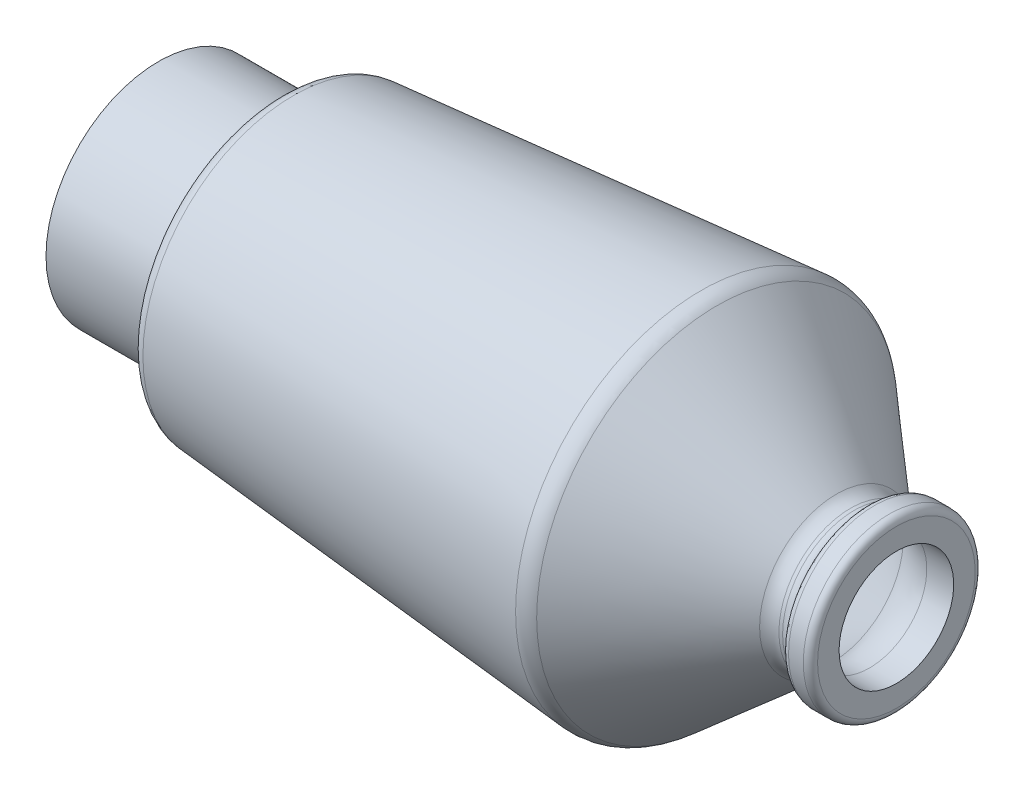
ISO-10303-21;
HEADER;
FILE_DESCRIPTION(('STEP AP214'),'2;1');
FILE_NAME('part.step','',(''),(''),'','','');
FILE_SCHEMA(('AUTOMOTIVE_DESIGN { 1 0 10303 214 1 1 1 1 }'));
ENDSEC;
DATA;
#1=APPLICATION_CONTEXT('core data for automotive mechanical design processes');
#2=APPLICATION_PROTOCOL_DEFINITION('international standard','automotive_design',2000,#1);
#3=PRODUCT_CONTEXT('',#1,'mechanical');
#4=PRODUCT('Part','Part','',(#3));
#5=PRODUCT_RELATED_PRODUCT_CATEGORY('part','',(#4));
#6=PRODUCT_DEFINITION_FORMATION('','',#4);
#7=PRODUCT_DEFINITION_CONTEXT('part definition',#1,'design');
#8=PRODUCT_DEFINITION('design','',#6,#7);
#9=PRODUCT_DEFINITION_SHAPE('','',#8);
#10=(LENGTH_UNIT() NAMED_UNIT(*) SI_UNIT(.MILLI.,.METRE.));
#11=(NAMED_UNIT(*) PLANE_ANGLE_UNIT() SI_UNIT($,.RADIAN.));
#12=(NAMED_UNIT(*) SI_UNIT($,.STERADIAN.) SOLID_ANGLE_UNIT());
#13=UNCERTAINTY_MEASURE_WITH_UNIT(LENGTH_MEASURE(1.E-05),#10,'distance_accuracy_value','');
#14=(GEOMETRIC_REPRESENTATION_CONTEXT(3) GLOBAL_UNCERTAINTY_ASSIGNED_CONTEXT((#13)) GLOBAL_UNIT_ASSIGNED_CONTEXT((#10,
#11,#12)) REPRESENTATION_CONTEXT('',''));
#15=CARTESIAN_POINT('',(0.,0.,0.));
#16=DIRECTION('',(0.,0.,1.));
#17=DIRECTION('',(1.,0.,0.));
#18=AXIS2_PLACEMENT_3D('',#15,#16,#17);
#19=CARTESIAN_POINT('',(0.,7.35,0.));
#20=DIRECTION('',(1.,0.,0.));
#21=DIRECTION('',(0.,0.,-1.));
#22=AXIS2_PLACEMENT_3D('',#19,#20,#21);
#23=PLANE('',#22);
#24=CARTESIAN_POINT('',(0.,0.,0.));
#25=DIRECTION('',(-1.,0.,0.));
#26=DIRECTION('',(0.,0.,1.));
#27=AXIS2_PLACEMENT_3D('',#24,#25,#26);
#28=CIRCLE('',#27,7.35);
#29=CARTESIAN_POINT('',(0.,0.,7.35));
#30=VERTEX_POINT('',#29);
#31=EDGE_CURVE('E10',#30,#30,#28,.T.);
#32=ORIENTED_EDGE('',*,*,#31,.F.);
#33=EDGE_LOOP('',(#32));
#34=FACE_BOUND('',#33,.T.);
#35=CARTESIAN_POINT('',(0.,0.,0.));
#36=DIRECTION('',(-1.,0.,0.));
#37=DIRECTION('',(0.,0.,1.));
#38=AXIS2_PLACEMENT_3D('',#35,#36,#37);
#39=CIRCLE('',#38,7.85);
#40=CARTESIAN_POINT('',(0.,0.,7.85));
#41=VERTEX_POINT('',#40);
#42=EDGE_CURVE('E105',#41,#41,#39,.T.);
#43=ORIENTED_EDGE('',*,*,#42,.T.);
#44=EDGE_LOOP('',(#43));
#45=FACE_BOUND('',#44,.T.);
#46=ADVANCED_FACE('F29',(#34,#45),#23,.F.);
#47=CARTESIAN_POINT('',(0.,0.,0.));
#48=DIRECTION('',(-1.,0.,0.));
#49=DIRECTION('',(0.,0.,1.));
#50=AXIS2_PLACEMENT_3D('',#47,#48,#49);
#51=CYLINDRICAL_SURFACE('',#50,7.35);
#52=CARTESIAN_POINT('',(7.5,0.,0.));
#53=DIRECTION('',(-1.,0.,0.));
#54=DIRECTION('',(0.,0.,1.));
#55=AXIS2_PLACEMENT_3D('',#52,#53,#54);
#56=CIRCLE('',#55,7.35);
#57=CARTESIAN_POINT('',(7.5,0.,7.35));
#58=VERTEX_POINT('',#57);
#59=EDGE_CURVE('E35',#58,#58,#56,.T.);
#60=ORIENTED_EDGE('',*,*,#59,.F.);
#61=EDGE_LOOP('',(#60));
#62=FACE_BOUND('',#61,.T.);
#63=ORIENTED_EDGE('',*,*,#31,.T.);
#64=EDGE_LOOP('',(#63));
#65=FACE_BOUND('',#64,.T.);
#66=ADVANCED_FACE('F238',(#62,#65),#51,.F.);
#67=CARTESIAN_POINT('',(7.5,0.,0.));
#68=DIRECTION('',(-1.,0.,0.));
#69=DIRECTION('',(0.,0.,1.));
#70=AXIS2_PLACEMENT_3D('',#67,#68,#69);
#71=TOROIDAL_SURFACE('',#70,8.85,1.5);
#72=CARTESIAN_POINT('',(9.,0.,0.));
#73=DIRECTION('',(-1.,0.,0.));
#74=DIRECTION('',(0.,0.,1.));
#75=AXIS2_PLACEMENT_3D('',#72,#73,#74);
#76=CIRCLE('',#75,8.85000000000001);
#77=CARTESIAN_POINT('',(9.,0.,8.85000000000001));
#78=VERTEX_POINT('',#77);
#79=EDGE_CURVE('E39',#78,#78,#76,.T.);
#80=ORIENTED_EDGE('',*,*,#79,.F.);
#81=EDGE_LOOP('',(#80));
#82=FACE_BOUND('',#81,.T.);
#83=ORIENTED_EDGE('',*,*,#59,.T.);
#84=EDGE_LOOP('',(#83));
#85=FACE_BOUND('',#84,.T.);
#86=ADVANCED_FACE('F233',(#82,#85),#71,.T.);
#87=CARTESIAN_POINT('',(9.,9.50367362278359,0.));
#88=DIRECTION('',(-1.,0.,0.));
#89=DIRECTION('',(0.,0.,1.));
#90=AXIS2_PLACEMENT_3D('',#87,#88,#89);
#91=PLANE('',#90);
#92=CARTESIAN_POINT('',(9.,0.,0.));
#93=DIRECTION('',(-1.,0.,0.));
#94=DIRECTION('',(0.,0.,1.));
#95=AXIS2_PLACEMENT_3D('',#92,#93,#94);
#96=CIRCLE('',#95,9.50367362278359);
#97=CARTESIAN_POINT('',(9.,0.,9.50367362278359));
#98=VERTEX_POINT('',#97);
#99=EDGE_CURVE('E43',#98,#98,#96,.T.);
#100=ORIENTED_EDGE('',*,*,#99,.F.);
#101=EDGE_LOOP('',(#100));
#102=FACE_BOUND('',#101,.T.);
#103=ORIENTED_EDGE('',*,*,#79,.T.);
#104=EDGE_LOOP('',(#103));
#105=FACE_BOUND('',#104,.T.);
#106=ADVANCED_FACE('F227',(#102,#105),#91,.F.);
#107=CARTESIAN_POINT('',(9.5,0.,0.));
#108=DIRECTION('',(-1.,0.,0.));
#109=DIRECTION('',(0.,0.,1.));
#110=AXIS2_PLACEMENT_3D('',#107,#108,#109);
#111=TOROIDAL_SURFACE('',#110,9.50367362278359,0.499999999999999);
#112=CARTESIAN_POINT('',(9.45718134150037,0.,0.));
#113=DIRECTION('',(-1.,0.,0.));
#114=DIRECTION('',(0.,0.,1.));
#115=AXIS2_PLACEMENT_3D('',#112,#113,#114);
#116=CIRCLE('',#115,10.0018368113918);
#117=CARTESIAN_POINT('',(9.45718134150037,0.,10.0018368113918));
#118=VERTEX_POINT('',#117);
#119=EDGE_CURVE('E48',#118,#118,#116,.T.);
#120=ORIENTED_EDGE('',*,*,#119,.F.);
#121=EDGE_LOOP('',(#120));
#122=FACE_BOUND('',#121,.T.);
#123=ORIENTED_EDGE('',*,*,#99,.T.);
#124=EDGE_LOOP('',(#123));
#125=FACE_BOUND('',#124,.T.);
#126=ADVANCED_FACE('F221',(#122,#125),#111,.F.);
#127=CARTESIAN_POINT('',(9.45718134150037,0.,0.));
#128=DIRECTION('',(1.,0.,0.));
#129=DIRECTION('',(0.,0.,-1.));
#130=AXIS2_PLACEMENT_3D('',#127,#128,#129);
#131=CONICAL_SURFACE('',#130,10.0018368113918,0.0857423377377106);
#132=CARTESIAN_POINT('',(37.9115843966206,0.,0.));
#133=DIRECTION('',(-1.,0.,0.));
#134=DIRECTION('',(0.,0.,1.));
#135=AXIS2_PLACEMENT_3D('',#132,#133,#134);
#136=CIRCLE('',#135,12.4475802847942);
#137=CARTESIAN_POINT('',(37.9115843966206,0.,12.4475802847942));
#138=VERTEX_POINT('',#137);
#139=EDGE_CURVE('E51',#138,#138,#136,.T.);
#140=ORIENTED_EDGE('',*,*,#139,.F.);
#141=EDGE_LOOP('',(#140));
#142=FACE_BOUND('',#141,.T.);
#143=ORIENTED_EDGE('',*,*,#119,.T.);
#144=EDGE_LOOP('',(#143));
#145=FACE_BOUND('',#144,.T.);
#146=ADVANCED_FACE('F215',(#142,#145),#131,.F.);
#147=CARTESIAN_POINT('',(37.9972217136199,0.,0.));
#148=DIRECTION('',(-1.,0.,0.));
#149=DIRECTION('',(0.,0.,1.));
#150=AXIS2_PLACEMENT_3D('',#147,#148,#149);
#151=TOROIDAL_SURFACE('',#150,11.4512539075778,0.999999999999999);
#152=CARTESIAN_POINT('',(38.6517413551086,0.,0.));
#153=DIRECTION('',(-1.,0.,0.));
#154=DIRECTION('',(0.,0.,1.));
#155=AXIS2_PLACEMENT_3D('',#152,#153,#154);
#156=CIRCLE('',#155,12.2072989055147);
#157=CARTESIAN_POINT('',(38.6517413551086,0.,12.2072989055147));
#158=VERTEX_POINT('',#157);
#159=EDGE_CURVE('E54',#158,#158,#156,.T.);
#160=ORIENTED_EDGE('',*,*,#159,.F.);
#161=EDGE_LOOP('',(#160));
#162=FACE_BOUND('',#161,.T.);
#163=ORIENTED_EDGE('',*,*,#139,.T.);
#164=EDGE_LOOP('',(#163));
#165=FACE_BOUND('',#164,.T.);
#166=ADVANCED_FACE('F209',(#162,#165),#151,.F.);
#167=CARTESIAN_POINT('',(38.6517413551086,0.,0.));
#168=DIRECTION('',(-1.,0.,0.));
#169=DIRECTION('',(0.,0.,1.));
#170=AXIS2_PLACEMENT_3D('',#167,#168,#169);
#171=CONICAL_SURFACE('',#170,12.2072989055147,0.713547088563014);
#172=CARTESIAN_POINT('',(47.0049260441511,0.,0.));
#173=DIRECTION('',(-1.,0.,0.));
#174=DIRECTION('',(0.,0.,1.));
#175=AXIS2_PLACEMENT_3D('',#172,#173,#174);
#176=CIRCLE('',#175,4.97582000825237);
#177=CARTESIAN_POINT('',(47.0049260441511,0.,4.97582000825237));
#178=VERTEX_POINT('',#177);
#179=EDGE_CURVE('E57',#178,#178,#176,.T.);
#180=ORIENTED_EDGE('',*,*,#179,.F.);
#181=EDGE_LOOP('',(#180));
#182=FACE_BOUND('',#181,.T.);
#183=ORIENTED_EDGE('',*,*,#159,.T.);
#184=EDGE_LOOP('',(#183));
#185=FACE_BOUND('',#184,.T.);
#186=ADVANCED_FACE('F203',(#182,#185),#171,.F.);
#187=CARTESIAN_POINT('',(49.6230046101061,0.,0.));
#188=DIRECTION('',(-1.,0.,0.));
#189=DIRECTION('',(0.,0.,1.));
#190=AXIS2_PLACEMENT_3D('',#187,#188,#189);
#191=TOROIDAL_SURFACE('',#190,8.,4.);
#192=CARTESIAN_POINT('',(49.6230046101061,0.,0.));
#193=DIRECTION('',(-1.,0.,0.));
#194=DIRECTION('',(0.,0.,1.));
#195=AXIS2_PLACEMENT_3D('',#192,#193,#194);
#196=CIRCLE('',#195,4.);
#197=CARTESIAN_POINT('',(49.6230046101061,0.,4.));
#198=VERTEX_POINT('',#197);
#199=EDGE_CURVE('E60',#198,#198,#196,.T.);
#200=ORIENTED_EDGE('',*,*,#199,.F.);
#201=EDGE_LOOP('',(#200));
#202=FACE_BOUND('',#201,.T.);
#203=ORIENTED_EDGE('',*,*,#179,.T.);
#204=EDGE_LOOP('',(#203));
#205=FACE_BOUND('',#204,.T.);
#206=ADVANCED_FACE('F197',(#202,#205),#191,.T.);
#207=CARTESIAN_POINT('',(0.,0.,0.));
#208=DIRECTION('',(-1.,0.,0.));
#209=DIRECTION('',(0.,0.,1.));
#210=AXIS2_PLACEMENT_3D('',#207,#208,#209);
#211=CYLINDRICAL_SURFACE('',#210,4.);
#212=CARTESIAN_POINT('',(51.5,0.,0.));
#213=DIRECTION('',(-1.,0.,0.));
#214=DIRECTION('',(0.,0.,1.));
#215=AXIS2_PLACEMENT_3D('',#212,#213,#214);
#216=CIRCLE('',#215,4.);
#217=CARTESIAN_POINT('',(51.5,0.,4.));
#218=VERTEX_POINT('',#217);
#219=EDGE_CURVE('E63',#218,#218,#216,.T.);
#220=ORIENTED_EDGE('',*,*,#219,.F.);
#221=EDGE_LOOP('',(#220));
#222=FACE_BOUND('',#221,.T.);
#223=ORIENTED_EDGE('',*,*,#199,.T.);
#224=EDGE_LOOP('',(#223));
#225=FACE_BOUND('',#224,.T.);
#226=ADVANCED_FACE('F191',(#222,#225),#211,.F.);
#227=CARTESIAN_POINT('',(51.5,5.5,0.));
#228=DIRECTION('',(-1.,0.,0.));
#229=DIRECTION('',(0.,0.,1.));
#230=AXIS2_PLACEMENT_3D('',#227,#228,#229);
#231=PLANE('',#230);
#232=CARTESIAN_POINT('',(51.5,0.,0.));
#233=DIRECTION('',(-1.,0.,0.));
#234=DIRECTION('',(0.,0.,1.));
#235=AXIS2_PLACEMENT_3D('',#232,#233,#234);
#236=CIRCLE('',#235,5.5);
#237=CARTESIAN_POINT('',(51.5,0.,5.5));
#238=VERTEX_POINT('',#237);
#239=EDGE_CURVE('E66',#238,#238,#236,.T.);
#240=ORIENTED_EDGE('',*,*,#239,.F.);
#241=EDGE_LOOP('',(#240));
#242=FACE_BOUND('',#241,.T.);
#243=ORIENTED_EDGE('',*,*,#219,.T.);
#244=EDGE_LOOP('',(#243));
#245=FACE_BOUND('',#244,.T.);
#246=ADVANCED_FACE('F185',(#242,#245),#231,.F.);
#247=CARTESIAN_POINT('',(51.,0.,0.));
#248=DIRECTION('',(-1.,0.,0.));
#249=DIRECTION('',(0.,0.,1.));
#250=AXIS2_PLACEMENT_3D('',#247,#248,#249);
#251=TOROIDAL_SURFACE('',#250,5.5,0.499999999999997);
#252=CARTESIAN_POINT('',(51.,0.,0.));
#253=DIRECTION('',(-1.,0.,0.));
#254=DIRECTION('',(0.,0.,1.));
#255=AXIS2_PLACEMENT_3D('',#252,#253,#254);
#256=CIRCLE('',#255,6.);
#257=CARTESIAN_POINT('',(51.,0.,6.));
#258=VERTEX_POINT('',#257);
#259=EDGE_CURVE('E69',#258,#258,#256,.T.);
#260=ORIENTED_EDGE('',*,*,#259,.F.);
#261=EDGE_LOOP('',(#260));
#262=FACE_BOUND('',#261,.T.);
#263=ORIENTED_EDGE('',*,*,#239,.T.);
#264=EDGE_LOOP('',(#263));
#265=FACE_BOUND('',#264,.T.);
#266=ADVANCED_FACE('F179',(#262,#265),#251,.T.);
#267=CARTESIAN_POINT('',(0.,0.,0.));
#268=DIRECTION('',(-1.,0.,0.));
#269=DIRECTION('',(0.,0.,1.));
#270=AXIS2_PLACEMENT_3D('',#267,#268,#269);
#271=CYLINDRICAL_SURFACE('',#270,6.);
#272=CARTESIAN_POINT('',(49.971404520791,0.,0.));
#273=DIRECTION('',(-1.,0.,0.));
#274=DIRECTION('',(0.,0.,1.));
#275=AXIS2_PLACEMENT_3D('',#272,#273,#274);
#276=CIRCLE('',#275,6.);
#277=CARTESIAN_POINT('',(49.971404520791,0.,6.));
#278=VERTEX_POINT('',#277);
#279=EDGE_CURVE('E72',#278,#278,#276,.T.);
#280=ORIENTED_EDGE('',*,*,#279,.F.);
#281=EDGE_LOOP('',(#280));
#282=FACE_BOUND('',#281,.T.);
#283=ORIENTED_EDGE('',*,*,#259,.T.);
#284=EDGE_LOOP('',(#283));
#285=FACE_BOUND('',#284,.T.);
#286=ADVANCED_FACE('F173',(#282,#285),#271,.T.);
#287=CARTESIAN_POINT('',(49.971404520791,0.,0.));
#288=DIRECTION('',(-1.,0.,0.));
#289=DIRECTION('',(0.,0.,1.));
#290=AXIS2_PLACEMENT_3D('',#287,#288,#289);
#291=TOROIDAL_SURFACE('',#290,5.5,0.5);
#292=CARTESIAN_POINT('',(49.5,0.,0.));
#293=DIRECTION('',(-1.,0.,0.));
#294=DIRECTION('',(0.,0.,1.));
#295=AXIS2_PLACEMENT_3D('',#292,#293,#294);
#296=CIRCLE('',#295,5.66666666666667);
#297=CARTESIAN_POINT('',(49.5,0.,5.66666666666667));
#298=VERTEX_POINT('',#297);
#299=EDGE_CURVE('E75',#298,#298,#296,.T.);
#300=ORIENTED_EDGE('',*,*,#299,.F.);
#301=EDGE_LOOP('',(#300));
#302=FACE_BOUND('',#301,.T.);
#303=ORIENTED_EDGE('',*,*,#279,.T.);
#304=EDGE_LOOP('',(#303));
#305=FACE_BOUND('',#304,.T.);
#306=ADVANCED_FACE('F167',(#302,#305),#291,.T.);
#307=CARTESIAN_POINT('',(48.5571909584179,0.,0.));
#308=DIRECTION('',(-1.,0.,0.));
#309=DIRECTION('',(0.,0.,1.));
#310=AXIS2_PLACEMENT_3D('',#307,#308,#309);
#311=TOROIDAL_SURFACE('',#310,6.,1.);
#312=CARTESIAN_POINT('',(48.5571909584179,0.,0.));
#313=DIRECTION('',(-1.,0.,0.));
#314=DIRECTION('',(0.,0.,1.));
#315=AXIS2_PLACEMENT_3D('',#312,#313,#314);
#316=CIRCLE('',#315,5.);
#317=CARTESIAN_POINT('',(48.5571909584179,0.,5.));
#318=VERTEX_POINT('',#317);
#319=EDGE_CURVE('E78',#318,#318,#316,.T.);
#320=ORIENTED_EDGE('',*,*,#319,.F.);
#321=EDGE_LOOP('',(#320));
#322=FACE_BOUND('',#321,.T.);
#323=ORIENTED_EDGE('',*,*,#299,.T.);
#324=EDGE_LOOP('',(#323));
#325=FACE_BOUND('',#324,.T.);
#326=ADVANCED_FACE('F161',(#322,#325),#311,.F.);
#327=CARTESIAN_POINT('',(0.,0.,0.));
#328=DIRECTION('',(-1.,0.,0.));
#329=DIRECTION('',(0.,0.,1.));
#330=AXIS2_PLACEMENT_3D('',#327,#328,#329);
#331=CYLINDRICAL_SURFACE('',#330,5.);
#332=CARTESIAN_POINT('',(48.3,0.,0.));
#333=DIRECTION('',(-1.,0.,0.));
#334=DIRECTION('',(0.,0.,1.));
#335=AXIS2_PLACEMENT_3D('',#332,#333,#334);
#336=CIRCLE('',#335,5.);
#337=CARTESIAN_POINT('',(48.3,0.,5.));
#338=VERTEX_POINT('',#337);
#339=EDGE_CURVE('E81',#338,#338,#336,.T.);
#340=ORIENTED_EDGE('',*,*,#339,.F.);
#341=EDGE_LOOP('',(#340));
#342=FACE_BOUND('',#341,.T.);
#343=ORIENTED_EDGE('',*,*,#319,.T.);
#344=EDGE_LOOP('',(#343));
#345=FACE_BOUND('',#344,.T.);
#346=ADVANCED_FACE('F155',(#342,#345),#331,.T.);
#347=CARTESIAN_POINT('',(48.3,0.,0.));
#348=DIRECTION('',(-1.,0.,0.));
#349=DIRECTION('',(0.,0.,1.));
#350=AXIS2_PLACEMENT_3D('',#347,#348,#349);
#351=TOROIDAL_SURFACE('',#350,6.5,1.5);
#352=CARTESIAN_POINT('',(47.3182205377668,0.,0.));
#353=DIRECTION('',(-1.,0.,0.));
#354=DIRECTION('',(0.,0.,1.));
#355=AXIS2_PLACEMENT_3D('',#352,#353,#354);
#356=CIRCLE('',#355,5.36593250309464);
#357=CARTESIAN_POINT('',(47.3182205377668,0.,5.36593250309464));
#358=VERTEX_POINT('',#357);
#359=EDGE_CURVE('E84',#358,#358,#356,.T.);
#360=ORIENTED_EDGE('',*,*,#359,.F.);
#361=EDGE_LOOP('',(#360));
#362=FACE_BOUND('',#361,.T.);
#363=ORIENTED_EDGE('',*,*,#339,.T.);
#364=EDGE_LOOP('',(#363));
#365=FACE_BOUND('',#364,.T.);
#366=ADVANCED_FACE('F149',(#362,#365),#351,.F.);
#367=CARTESIAN_POINT('',(47.3182205377668,0.,0.));
#368=DIRECTION('',(-1.,0.,0.));
#369=DIRECTION('',(0.,0.,1.));
#370=AXIS2_PLACEMENT_3D('',#367,#368,#369);
#371=CONICAL_SURFACE('',#370,5.36593250309464,0.713547088563015);
#372=CARTESIAN_POINT('',(38.979001175853,0.,0.));
#373=DIRECTION('',(-1.,0.,0.));
#374=DIRECTION('',(0.,0.,1.));
#375=AXIS2_PLACEMENT_3D('',#372,#373,#374);
#376=CIRCLE('',#375,12.5853214044832);
#377=CARTESIAN_POINT('',(38.979001175853,0.,12.5853214044832));
#378=VERTEX_POINT('',#377);
#379=EDGE_CURVE('E87',#378,#378,#376,.T.);
#380=ORIENTED_EDGE('',*,*,#379,.F.);
#381=EDGE_LOOP('',(#380));
#382=FACE_BOUND('',#381,.T.);
#383=ORIENTED_EDGE('',*,*,#359,.T.);
#384=EDGE_LOOP('',(#383));
#385=FACE_BOUND('',#384,.T.);
#386=ADVANCED_FACE('F143',(#382,#385),#371,.T.);
#387=CARTESIAN_POINT('',(37.9972217136199,0.,0.));
#388=DIRECTION('',(-1.,0.,0.));
#389=DIRECTION('',(0.,0.,1.));
#390=AXIS2_PLACEMENT_3D('',#387,#388,#389);
#391=TOROIDAL_SURFACE('',#390,11.4512539075778,1.5);
#392=CARTESIAN_POINT('',(37.868765738121,0.,0.));
#393=DIRECTION('',(-1.,0.,0.));
#394=DIRECTION('',(0.,0.,1.));
#395=AXIS2_PLACEMENT_3D('',#392,#393,#394);
#396=CIRCLE('',#395,12.9457434734024);
#397=CARTESIAN_POINT('',(37.868765738121,0.,12.9457434734024));
#398=VERTEX_POINT('',#397);
#399=EDGE_CURVE('E90',#398,#398,#396,.T.);
#400=ORIENTED_EDGE('',*,*,#399,.F.);
#401=EDGE_LOOP('',(#400));
#402=FACE_BOUND('',#401,.T.);
#403=ORIENTED_EDGE('',*,*,#379,.T.);
#404=EDGE_LOOP('',(#403));
#405=FACE_BOUND('',#404,.T.);
#406=ADVANCED_FACE('F137',(#402,#405),#391,.T.);
#407=CARTESIAN_POINT('',(37.868765738121,0.,0.));
#408=DIRECTION('',(1.,0.,0.));
#409=DIRECTION('',(0.,0.,-1.));
#410=AXIS2_PLACEMENT_3D('',#407,#408,#409);
#411=CONICAL_SURFACE('',#410,12.9457434734024,0.0857423377377106);
#412=CARTESIAN_POINT('',(9.41436268300075,0.,0.));
#413=DIRECTION('',(-1.,0.,0.));
#414=DIRECTION('',(0.,0.,1.));
#415=AXIS2_PLACEMENT_3D('',#412,#413,#414);
#416=CIRCLE('',#415,10.5);
#417=CARTESIAN_POINT('',(9.41436268300075,0.,10.5));
#418=VERTEX_POINT('',#417);
#419=EDGE_CURVE('E93',#418,#418,#416,.T.);
#420=ORIENTED_EDGE('',*,*,#419,.F.);
#421=EDGE_LOOP('',(#420));
#422=FACE_BOUND('',#421,.T.);
#423=ORIENTED_EDGE('',*,*,#399,.T.);
#424=EDGE_LOOP('',(#423));
#425=FACE_BOUND('',#424,.T.);
#426=ADVANCED_FACE('F131',(#422,#425),#411,.T.);
#427=CARTESIAN_POINT('',(9.5,0.,0.));
#428=DIRECTION('',(-1.,0.,0.));
#429=DIRECTION('',(0.,0.,1.));
#430=AXIS2_PLACEMENT_3D('',#427,#428,#429);
#431=TOROIDAL_SURFACE('',#430,9.50367362278359,1.);
#432=CARTESIAN_POINT('',(8.49999999999999,0.,0.));
#433=DIRECTION('',(-1.,0.,0.));
#434=DIRECTION('',(0.,0.,1.));
#435=AXIS2_PLACEMENT_3D('',#432,#433,#434);
#436=CIRCLE('',#435,9.50367362278359);
#437=CARTESIAN_POINT('',(8.49999999999999,0.,9.50367362278359));
#438=VERTEX_POINT('',#437);
#439=EDGE_CURVE('E96',#438,#438,#436,.T.);
#440=ORIENTED_EDGE('',*,*,#439,.F.);
#441=EDGE_LOOP('',(#440));
#442=FACE_BOUND('',#441,.T.);
#443=ORIENTED_EDGE('',*,*,#419,.T.);
#444=EDGE_LOOP('',(#443));
#445=FACE_BOUND('',#444,.T.);
#446=ADVANCED_FACE('F125',(#442,#445),#431,.T.);
#447=CARTESIAN_POINT('',(8.5,8.85,0.));
#448=DIRECTION('',(1.,0.,0.));
#449=DIRECTION('',(0.,0.,-1.));
#450=AXIS2_PLACEMENT_3D('',#447,#448,#449);
#451=PLANE('',#450);
#452=CARTESIAN_POINT('',(8.5,0.,0.));
#453=DIRECTION('',(-1.,0.,0.));
#454=DIRECTION('',(0.,0.,1.));
#455=AXIS2_PLACEMENT_3D('',#452,#453,#454);
#456=CIRCLE('',#455,8.85);
#457=CARTESIAN_POINT('',(8.5,0.,8.85));
#458=VERTEX_POINT('',#457);
#459=EDGE_CURVE('E99',#458,#458,#456,.T.);
#460=ORIENTED_EDGE('',*,*,#459,.F.);
#461=EDGE_LOOP('',(#460));
#462=FACE_BOUND('',#461,.T.);
#463=ORIENTED_EDGE('',*,*,#439,.T.);
#464=EDGE_LOOP('',(#463));
#465=FACE_BOUND('',#464,.T.);
#466=ADVANCED_FACE('F119',(#462,#465),#451,.F.);
#467=CARTESIAN_POINT('',(7.5,0.,0.));
#468=DIRECTION('',(-1.,0.,0.));
#469=DIRECTION('',(0.,0.,1.));
#470=AXIS2_PLACEMENT_3D('',#467,#468,#469);
#471=TOROIDAL_SURFACE('',#470,8.85,0.999999999999998);
#472=CARTESIAN_POINT('',(7.5,0.,0.));
#473=DIRECTION('',(-1.,0.,0.));
#474=DIRECTION('',(0.,0.,1.));
#475=AXIS2_PLACEMENT_3D('',#472,#473,#474);
#476=CIRCLE('',#475,7.85);
#477=CARTESIAN_POINT('',(7.5,0.,7.85));
#478=VERTEX_POINT('',#477);
#479=EDGE_CURVE('E102',#478,#478,#476,.T.);
#480=ORIENTED_EDGE('',*,*,#479,.F.);
#481=EDGE_LOOP('',(#480));
#482=FACE_BOUND('',#481,.T.);
#483=ORIENTED_EDGE('',*,*,#459,.T.);
#484=EDGE_LOOP('',(#483));
#485=FACE_BOUND('',#484,.T.);
#486=ADVANCED_FACE('F113',(#482,#485),#471,.F.);
#487=CARTESIAN_POINT('',(0.,0.,0.));
#488=DIRECTION('',(-1.,0.,0.));
#489=DIRECTION('',(0.,0.,1.));
#490=AXIS2_PLACEMENT_3D('',#487,#488,#489);
#491=CYLINDRICAL_SURFACE('',#490,7.85);
#492=ORIENTED_EDGE('',*,*,#42,.F.);
#493=EDGE_LOOP('',(#492));
#494=FACE_BOUND('',#493,.T.);
#495=ORIENTED_EDGE('',*,*,#479,.T.);
#496=EDGE_LOOP('',(#495));
#497=FACE_BOUND('',#496,.T.);
#498=ADVANCED_FACE('F110',(#494,#497),#491,.T.);
#499=CLOSED_SHELL('',(#46,#66,#86,#106,#126,#146,#166,#186,#206,#226,#246,#266,#286,#306,#326,
#346,#366,#386,#406,#426,#446,#466,#486,#498));
#500=MANIFOLD_SOLID_BREP('B2',#499);
#501=ADVANCED_BREP_SHAPE_REPRESENTATION('',(#18,#500),#14);
#502=SHAPE_DEFINITION_REPRESENTATION(#9,#501);
ENDSEC;
END-ISO-10303-21;
